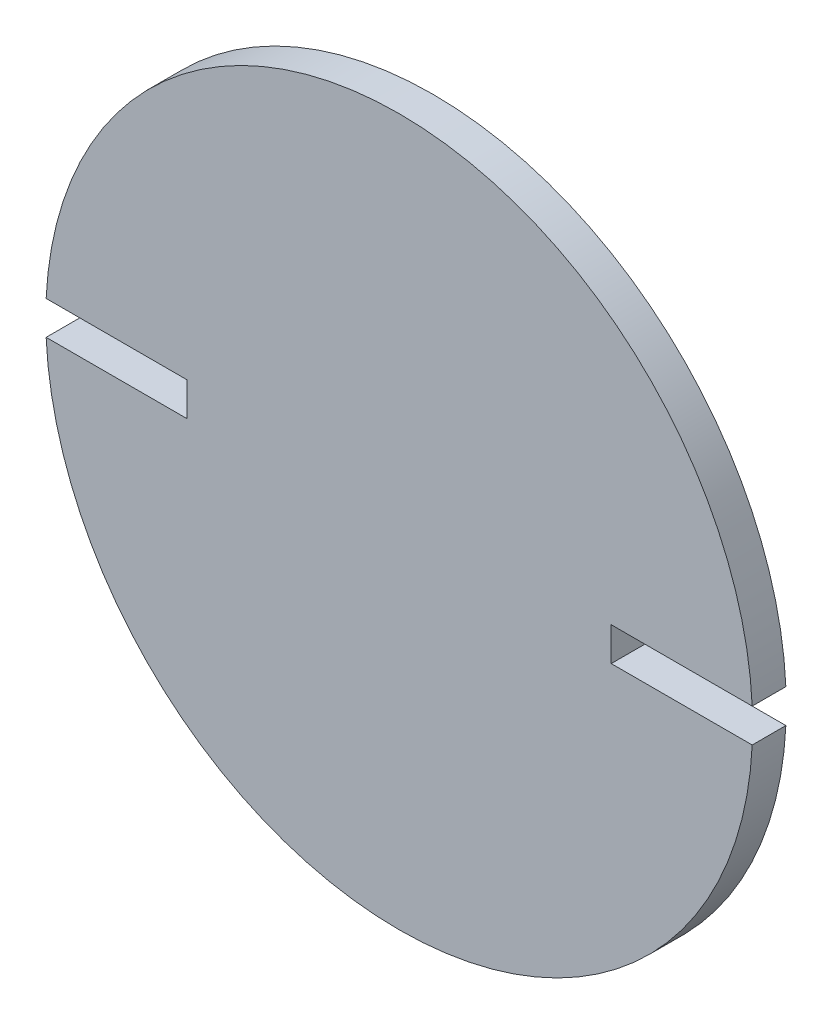
ISO-10303-21;
HEADER;
FILE_DESCRIPTION(('STEP AP214'),'2;1');
FILE_NAME('part.step','',(''),(''),'','','');
FILE_SCHEMA(('AUTOMOTIVE_DESIGN { 1 0 10303 214 1 1 1 1 }'));
ENDSEC;
DATA;
#1=APPLICATION_CONTEXT('core data for automotive mechanical design processes');
#2=APPLICATION_PROTOCOL_DEFINITION('international standard','automotive_design',2000,#1);
#3=PRODUCT_CONTEXT('',#1,'mechanical');
#4=PRODUCT('Part','Part','',(#3));
#5=PRODUCT_RELATED_PRODUCT_CATEGORY('part','',(#4));
#6=PRODUCT_DEFINITION_FORMATION('','',#4);
#7=PRODUCT_DEFINITION_CONTEXT('part definition',#1,'design');
#8=PRODUCT_DEFINITION('design','',#6,#7);
#9=PRODUCT_DEFINITION_SHAPE('','',#8);
#10=(LENGTH_UNIT() NAMED_UNIT(*) SI_UNIT(.MILLI.,.METRE.));
#11=(NAMED_UNIT(*) PLANE_ANGLE_UNIT() SI_UNIT($,.RADIAN.));
#12=(NAMED_UNIT(*) SI_UNIT($,.STERADIAN.) SOLID_ANGLE_UNIT());
#13=UNCERTAINTY_MEASURE_WITH_UNIT(LENGTH_MEASURE(1.E-05),#10,'distance_accuracy_value','');
#14=(GEOMETRIC_REPRESENTATION_CONTEXT(3) GLOBAL_UNCERTAINTY_ASSIGNED_CONTEXT((#13)) GLOBAL_UNIT_ASSIGNED_CONTEXT((#10,
#11,#12)) REPRESENTATION_CONTEXT('',''));
#15=CARTESIAN_POINT('',(0.,0.,0.));
#16=DIRECTION('',(0.,0.,1.));
#17=DIRECTION('',(1.,0.,0.));
#18=AXIS2_PLACEMENT_3D('',#15,#16,#17);
#19=CARTESIAN_POINT('',(0.,0.,6.35));
#20=DIRECTION('',(0.,0.,-1.));
#21=DIRECTION('',(-1.,0.,0.));
#22=AXIS2_PLACEMENT_3D('',#19,#20,#21);
#23=CYLINDRICAL_SURFACE('',#22,66.675);
#24=CARTESIAN_POINT('',(0.,0.,6.35));
#25=DIRECTION('',(0.,0.,1.));
#26=DIRECTION('',(1.,0.,0.));
#27=AXIS2_PLACEMENT_3D('',#24,#25,#26);
#28=CIRCLE('',#27,66.675);
#29=CARTESIAN_POINT('',(-66.5993618588046,-3.175,6.35));
#30=VERTEX_POINT('',#29);
#31=CARTESIAN_POINT('',(66.5993618588046,-3.175,6.35));
#32=VERTEX_POINT('',#31);
#33=EDGE_CURVE('E145',#30,#32,#28,.T.);
#34=ORIENTED_EDGE('',*,*,#33,.F.);
#35=DIRECTION('',(0.,0.,-1.));
#36=VECTOR('',#35,1.);
#37=CARTESIAN_POINT('',(-66.5993618588046,-3.175,6.35));
#38=LINE('',#37,#36);
#39=CARTESIAN_POINT('',(-66.5993618588046,-3.175,0.));
#40=VERTEX_POINT('',#39);
#41=EDGE_CURVE('E140',#30,#40,#38,.T.);
#42=ORIENTED_EDGE('',*,*,#41,.T.);
#43=CARTESIAN_POINT('',(0.,0.,0.));
#44=DIRECTION('',(0.,0.,1.));
#45=DIRECTION('',(1.,0.,0.));
#46=AXIS2_PLACEMENT_3D('',#43,#44,#45);
#47=CIRCLE('',#46,66.675);
#48=CARTESIAN_POINT('',(66.5993618588046,-3.175,0.));
#49=VERTEX_POINT('',#48);
#50=EDGE_CURVE('E133',#40,#49,#47,.T.);
#51=ORIENTED_EDGE('',*,*,#50,.T.);
#52=DIRECTION('',(0.,0.,-1.));
#53=VECTOR('',#52,1.);
#54=CARTESIAN_POINT('',(66.5993618588046,-3.175,6.35));
#55=LINE('',#54,#53);
#56=EDGE_CURVE('E166',#49,#32,#55,.F.);
#57=ORIENTED_EDGE('',*,*,#56,.T.);
#58=EDGE_LOOP('',(#34,#42,#51,#57));
#59=FACE_BOUND('',#58,.T.);
#60=ADVANCED_FACE('F44',(#59),#23,.T.);
#61=CARTESIAN_POINT('',(66.5993618588046,3.175,0.));
#62=VERTEX_POINT('',#61);
#63=CARTESIAN_POINT('',(-66.5993618588046,3.175,0.));
#64=VERTEX_POINT('',#63);
#65=EDGE_CURVE('E139',#62,#64,#47,.T.);
#66=ORIENTED_EDGE('',*,*,#65,.T.);
#67=DIRECTION('',(0.,0.,-1.));
#68=VECTOR('',#67,1.);
#69=CARTESIAN_POINT('',(-66.5993618588046,3.175,6.35));
#70=LINE('',#69,#68);
#71=CARTESIAN_POINT('',(-66.5993618588046,3.175,6.35));
#72=VERTEX_POINT('',#71);
#73=EDGE_CURVE('E146',#64,#72,#70,.F.);
#74=ORIENTED_EDGE('',*,*,#73,.T.);
#75=CARTESIAN_POINT('',(66.5993618588046,3.175,6.35));
#76=VERTEX_POINT('',#75);
#77=EDGE_CURVE('E149',#76,#72,#28,.T.);
#78=ORIENTED_EDGE('',*,*,#77,.F.);
#79=DIRECTION('',(0.,0.,-1.));
#80=VECTOR('',#79,1.);
#81=CARTESIAN_POINT('',(66.5993618588046,3.175,6.35));
#82=LINE('',#81,#80);
#83=EDGE_CURVE('E120',#76,#62,#82,.T.);
#84=ORIENTED_EDGE('',*,*,#83,.T.);
#85=EDGE_LOOP('',(#66,#74,#78,#84));
#86=FACE_BOUND('',#85,.T.);
#87=ADVANCED_FACE('F46',(#86),#23,.T.);
#88=CARTESIAN_POINT('',(0.,0.,6.35));
#89=DIRECTION('',(0.,0.,1.));
#90=DIRECTION('',(1.,0.,0.));
#91=AXIS2_PLACEMENT_3D('',#88,#89,#90);
#92=PLANE('',#91);
#93=DIRECTION('',(1.,0.,0.));
#94=VECTOR('',#93,1.);
#95=CARTESIAN_POINT('',(-67.945,-3.175,6.35));
#96=LINE('',#95,#94);
#97=CARTESIAN_POINT('',(-40.005,-3.175,6.35));
#98=VERTEX_POINT('',#97);
#99=EDGE_CURVE('E115',#30,#98,#96,.T.);
#100=ORIENTED_EDGE('',*,*,#99,.F.);
#101=ORIENTED_EDGE('',*,*,#33,.T.);
#102=DIRECTION('',(1.,0.,0.));
#103=VECTOR('',#102,1.);
#104=CARTESIAN_POINT('',(67.945,-3.175,6.35));
#105=LINE('',#104,#103);
#106=CARTESIAN_POINT('',(40.005,-3.175,6.35));
#107=VERTEX_POINT('',#106);
#108=EDGE_CURVE('E165',#107,#32,#105,.T.);
#109=ORIENTED_EDGE('',*,*,#108,.F.);
#110=DIRECTION('',(0.,-1.,0.));
#111=VECTOR('',#110,1.);
#112=CARTESIAN_POINT('',(40.005,-3.175,6.35));
#113=LINE('',#112,#111);
#114=CARTESIAN_POINT('',(40.005,3.175,6.35));
#115=VERTEX_POINT('',#114);
#116=EDGE_CURVE('E179',#115,#107,#113,.T.);
#117=ORIENTED_EDGE('',*,*,#116,.F.);
#118=DIRECTION('',(-1.,0.,0.));
#119=VECTOR('',#118,1.);
#120=CARTESIAN_POINT('',(40.005,3.175,6.35));
#121=LINE('',#120,#119);
#122=EDGE_CURVE('E186',#76,#115,#121,.T.);
#123=ORIENTED_EDGE('',*,*,#122,.F.);
#124=ORIENTED_EDGE('',*,*,#77,.T.);
#125=DIRECTION('',(-1.,0.,0.));
#126=VECTOR('',#125,1.);
#127=CARTESIAN_POINT('',(-40.005,3.175,6.35));
#128=LINE('',#127,#126);
#129=CARTESIAN_POINT('',(-40.005,3.175,6.35));
#130=VERTEX_POINT('',#129);
#131=EDGE_CURVE('E201',#130,#72,#128,.T.);
#132=ORIENTED_EDGE('',*,*,#131,.F.);
#133=DIRECTION('',(0.,1.,0.));
#134=VECTOR('',#133,1.);
#135=CARTESIAN_POINT('',(-40.005,0.,6.35));
#136=LINE('',#135,#134);
#137=EDGE_CURVE('E185',#98,#130,#136,.T.);
#138=ORIENTED_EDGE('',*,*,#137,.F.);
#139=EDGE_LOOP('',(#100,#101,#109,#117,#123,#124,#132,#138));
#140=FACE_BOUND('',#139,.T.);
#141=ADVANCED_FACE('F163',(#140),#92,.T.);
#142=CARTESIAN_POINT('',(0.,0.,0.));
#143=DIRECTION('',(0.,0.,1.));
#144=DIRECTION('',(1.,0.,0.));
#145=AXIS2_PLACEMENT_3D('',#142,#143,#144);
#146=PLANE('',#145);
#147=ORIENTED_EDGE('',*,*,#50,.F.);
#148=DIRECTION('',(1.,0.,0.));
#149=VECTOR('',#148,1.);
#150=CARTESIAN_POINT('',(0.,-3.175,0.));
#151=LINE('',#150,#149);
#152=CARTESIAN_POINT('',(-40.005,-3.175,0.));
#153=VERTEX_POINT('',#152);
#154=EDGE_CURVE('E11',#40,#153,#151,.T.);
#155=ORIENTED_EDGE('',*,*,#154,.T.);
#156=DIRECTION('',(0.,1.,0.));
#157=VECTOR('',#156,1.);
#158=CARTESIAN_POINT('',(-40.005,-3.175,0.));
#159=LINE('',#158,#157);
#160=CARTESIAN_POINT('',(-40.005,3.175,0.));
#161=VERTEX_POINT('',#160);
#162=EDGE_CURVE('E124',#153,#161,#159,.T.);
#163=ORIENTED_EDGE('',*,*,#162,.T.);
#164=DIRECTION('',(-1.,0.,0.));
#165=VECTOR('',#164,1.);
#166=CARTESIAN_POINT('',(-40.005,3.175,0.));
#167=LINE('',#166,#165);
#168=EDGE_CURVE('E60',#161,#64,#167,.T.);
#169=ORIENTED_EDGE('',*,*,#168,.T.);
#170=ORIENTED_EDGE('',*,*,#65,.F.);
#171=DIRECTION('',(-1.,0.,0.));
#172=VECTOR('',#171,1.);
#173=CARTESIAN_POINT('',(0.,3.17500000000001,0.));
#174=LINE('',#173,#172);
#175=CARTESIAN_POINT('',(40.005,3.175,0.));
#176=VERTEX_POINT('',#175);
#177=EDGE_CURVE('E53',#62,#176,#174,.T.);
#178=ORIENTED_EDGE('',*,*,#177,.T.);
#179=DIRECTION('',(0.,-1.,0.));
#180=VECTOR('',#179,1.);
#181=CARTESIAN_POINT('',(40.005,0.,0.));
#182=LINE('',#181,#180);
#183=CARTESIAN_POINT('',(40.005,-3.175,0.));
#184=VERTEX_POINT('',#183);
#185=EDGE_CURVE('E68',#176,#184,#182,.T.);
#186=ORIENTED_EDGE('',*,*,#185,.T.);
#187=DIRECTION('',(1.,0.,0.));
#188=VECTOR('',#187,1.);
#189=CARTESIAN_POINT('',(67.945,-3.175,0.));
#190=LINE('',#189,#188);
#191=EDGE_CURVE('E135',#184,#49,#190,.T.);
#192=ORIENTED_EDGE('',*,*,#191,.T.);
#193=EDGE_LOOP('',(#147,#155,#163,#169,#170,#178,#186,#192));
#194=FACE_BOUND('',#193,.T.);
#195=ADVANCED_FACE('F130',(#194),#146,.F.);
#196=CARTESIAN_POINT('',(67.945,-3.175,0.));
#197=DIRECTION('',(0.,-1.,0.));
#198=DIRECTION('',(1.,0.,0.));
#199=AXIS2_PLACEMENT_3D('',#196,#197,#198);
#200=PLANE('',#199);
#201=ORIENTED_EDGE('',*,*,#191,.F.);
#202=DIRECTION('',(0.,0.,1.));
#203=VECTOR('',#202,1.);
#204=CARTESIAN_POINT('',(40.005,-3.175,0.));
#205=LINE('',#204,#203);
#206=EDGE_CURVE('E192',#184,#107,#205,.T.);
#207=ORIENTED_EDGE('',*,*,#206,.T.);
#208=ORIENTED_EDGE('',*,*,#108,.T.);
#209=ORIENTED_EDGE('',*,*,#56,.F.);
#210=EDGE_LOOP('',(#201,#207,#208,#209));
#211=FACE_BOUND('',#210,.T.);
#212=ADVANCED_FACE('F211',(#211),#200,.F.);
#213=CARTESIAN_POINT('',(40.005,3.175,0.));
#214=DIRECTION('',(0.,1.,0.));
#215=DIRECTION('',(-1.,0.,0.));
#216=AXIS2_PLACEMENT_3D('',#213,#214,#215);
#217=PLANE('',#216);
#218=ORIENTED_EDGE('',*,*,#122,.T.);
#219=DIRECTION('',(0.,0.,1.));
#220=VECTOR('',#219,1.);
#221=CARTESIAN_POINT('',(40.005,3.175,0.));
#222=LINE('',#221,#220);
#223=EDGE_CURVE('E182',#176,#115,#222,.T.);
#224=ORIENTED_EDGE('',*,*,#223,.F.);
#225=ORIENTED_EDGE('',*,*,#177,.F.);
#226=ORIENTED_EDGE('',*,*,#83,.F.);
#227=EDGE_LOOP('',(#218,#224,#225,#226));
#228=FACE_BOUND('',#227,.T.);
#229=ADVANCED_FACE('F209',(#228),#217,.F.);
#230=CARTESIAN_POINT('',(40.005,-3.175,0.));
#231=DIRECTION('',(-1.,0.,0.));
#232=DIRECTION('',(0.,0.,1.));
#233=AXIS2_PLACEMENT_3D('',#230,#231,#232);
#234=PLANE('',#233);
#235=ORIENTED_EDGE('',*,*,#116,.T.);
#236=ORIENTED_EDGE('',*,*,#206,.F.);
#237=ORIENTED_EDGE('',*,*,#185,.F.);
#238=ORIENTED_EDGE('',*,*,#223,.T.);
#239=EDGE_LOOP('',(#235,#236,#237,#238));
#240=FACE_BOUND('',#239,.T.);
#241=ADVANCED_FACE('F210',(#240),#234,.F.);
#242=CARTESIAN_POINT('',(-67.945,-3.175,0.));
#243=DIRECTION('',(0.,-1.,0.));
#244=DIRECTION('',(1.,0.,0.));
#245=AXIS2_PLACEMENT_3D('',#242,#243,#244);
#246=PLANE('',#245);
#247=ORIENTED_EDGE('',*,*,#99,.T.);
#248=DIRECTION('',(0.,0.,1.));
#249=VECTOR('',#248,1.);
#250=CARTESIAN_POINT('',(-40.005,-3.175,0.));
#251=LINE('',#250,#249);
#252=EDGE_CURVE('E110',#153,#98,#251,.T.);
#253=ORIENTED_EDGE('',*,*,#252,.F.);
#254=ORIENTED_EDGE('',*,*,#154,.F.);
#255=ORIENTED_EDGE('',*,*,#41,.F.);
#256=EDGE_LOOP('',(#247,#253,#254,#255));
#257=FACE_BOUND('',#256,.T.);
#258=ADVANCED_FACE('F112',(#257),#246,.F.);
#259=CARTESIAN_POINT('',(-40.005,3.175,0.));
#260=DIRECTION('',(0.,1.,0.));
#261=DIRECTION('',(-1.,0.,0.));
#262=AXIS2_PLACEMENT_3D('',#259,#260,#261);
#263=PLANE('',#262);
#264=ORIENTED_EDGE('',*,*,#168,.F.);
#265=DIRECTION('',(0.,0.,1.));
#266=VECTOR('',#265,1.);
#267=CARTESIAN_POINT('',(-40.005,3.175,0.));
#268=LINE('',#267,#266);
#269=EDGE_CURVE('E121',#161,#130,#268,.T.);
#270=ORIENTED_EDGE('',*,*,#269,.T.);
#271=ORIENTED_EDGE('',*,*,#131,.T.);
#272=ORIENTED_EDGE('',*,*,#73,.F.);
#273=EDGE_LOOP('',(#264,#270,#271,#272));
#274=FACE_BOUND('',#273,.T.);
#275=ADVANCED_FACE('F235',(#274),#263,.F.);
#276=CARTESIAN_POINT('',(-40.005,0.,0.));
#277=DIRECTION('',(1.,0.,0.));
#278=DIRECTION('',(0.,0.,-1.));
#279=AXIS2_PLACEMENT_3D('',#276,#277,#278);
#280=PLANE('',#279);
#281=ORIENTED_EDGE('',*,*,#137,.T.);
#282=ORIENTED_EDGE('',*,*,#269,.F.);
#283=ORIENTED_EDGE('',*,*,#162,.F.);
#284=ORIENTED_EDGE('',*,*,#252,.T.);
#285=EDGE_LOOP('',(#281,#282,#283,#284));
#286=FACE_BOUND('',#285,.T.);
#287=ADVANCED_FACE('F125',(#286),#280,.F.);
#288=CLOSED_SHELL('',(#60,#87,#141,#195,#212,#229,#241,#258,#275,#287));
#289=MANIFOLD_SOLID_BREP('B2',#288);
#290=ADVANCED_BREP_SHAPE_REPRESENTATION('',(#18,#289),#14);
#291=SHAPE_DEFINITION_REPRESENTATION(#9,#290);
ENDSEC;
END-ISO-10303-21;
